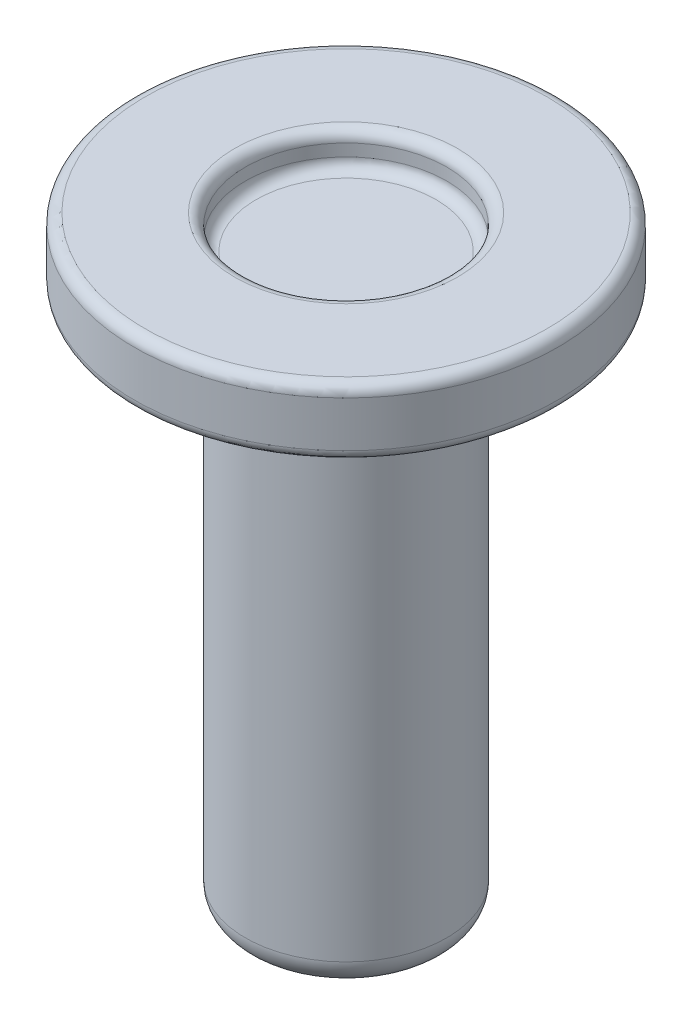
ISO-10303-21;
HEADER;
FILE_DESCRIPTION(('STEP AP214'),'2;1');
FILE_NAME('part.step','',(''),(''),'','','');
FILE_SCHEMA(('AUTOMOTIVE_DESIGN { 1 0 10303 214 1 1 1 1 }'));
ENDSEC;
DATA;
#1=APPLICATION_CONTEXT('core data for automotive mechanical design processes');
#2=APPLICATION_PROTOCOL_DEFINITION('international standard','automotive_design',2000,#1);
#3=PRODUCT_CONTEXT('',#1,'mechanical');
#4=PRODUCT('Part','Part','',(#3));
#5=PRODUCT_RELATED_PRODUCT_CATEGORY('part','',(#4));
#6=PRODUCT_DEFINITION_FORMATION('','',#4);
#7=PRODUCT_DEFINITION_CONTEXT('part definition',#1,'design');
#8=PRODUCT_DEFINITION('design','',#6,#7);
#9=PRODUCT_DEFINITION_SHAPE('','',#8);
#10=(LENGTH_UNIT() NAMED_UNIT(*) SI_UNIT(.MILLI.,.METRE.));
#11=(NAMED_UNIT(*) PLANE_ANGLE_UNIT() SI_UNIT($,.RADIAN.));
#12=(NAMED_UNIT(*) SI_UNIT($,.STERADIAN.) SOLID_ANGLE_UNIT());
#13=UNCERTAINTY_MEASURE_WITH_UNIT(LENGTH_MEASURE(1.E-05),#10,'distance_accuracy_value','');
#14=(GEOMETRIC_REPRESENTATION_CONTEXT(3) GLOBAL_UNCERTAINTY_ASSIGNED_CONTEXT((#13)) GLOBAL_UNIT_ASSIGNED_CONTEXT((#10,
#11,#12)) REPRESENTATION_CONTEXT('',''));
#15=CARTESIAN_POINT('',(0.,0.,0.));
#16=DIRECTION('',(0.,0.,1.));
#17=DIRECTION('',(1.,0.,0.));
#18=AXIS2_PLACEMENT_3D('',#15,#16,#17);
#19=CARTESIAN_POINT('',(-1.74625,-13.49375,0.));
#20=DIRECTION('',(0.,1.,0.));
#21=DIRECTION('',(0.,0.,1.));
#22=AXIS2_PLACEMENT_3D('',#19,#20,#21);
#23=PLANE('',#22);
#24=CARTESIAN_POINT('',(0.,-13.49375,0.));
#25=DIRECTION('',(0.,-1.,0.));
#26=DIRECTION('',(0.,0.,-1.));
#27=AXIS2_PLACEMENT_3D('',#24,#25,#26);
#28=CIRCLE('',#27,1.74625);
#29=CARTESIAN_POINT('',(0.,-13.49375,-1.74625));
#30=VERTEX_POINT('',#29);
#31=EDGE_CURVE('E10',#30,#30,#28,.T.);
#32=ORIENTED_EDGE('',*,*,#31,.T.);
#33=EDGE_LOOP('',(#32));
#34=FACE_BOUND('',#33,.T.);
#35=ADVANCED_FACE('F30',(#34),#23,.F.);
#36=CARTESIAN_POINT('',(0.,-12.85875,0.));
#37=DIRECTION('',(0.,-1.,0.));
#38=DIRECTION('',(0.,0.,-1.));
#39=AXIS2_PLACEMENT_3D('',#36,#37,#38);
#40=TOROIDAL_SURFACE('',#39,1.74625,0.635);
#41=ORIENTED_EDGE('',*,*,#31,.F.);
#42=EDGE_LOOP('',(#41));
#43=FACE_BOUND('',#42,.T.);
#44=CARTESIAN_POINT('',(0.,-12.85875,0.));
#45=DIRECTION('',(0.,-1.,0.));
#46=DIRECTION('',(0.,0.,-1.));
#47=AXIS2_PLACEMENT_3D('',#44,#45,#46);
#48=CIRCLE('',#47,2.38125);
#49=CARTESIAN_POINT('',(0.,-12.85875,-2.38125));
#50=VERTEX_POINT('',#49);
#51=EDGE_CURVE('E36',#50,#50,#48,.T.);
#52=ORIENTED_EDGE('',*,*,#51,.T.);
#53=EDGE_LOOP('',(#52));
#54=FACE_BOUND('',#53,.T.);
#55=ADVANCED_FACE('F86',(#43,#54),#40,.T.);
#56=CARTESIAN_POINT('',(0.,-13.49375,0.));
#57=DIRECTION('',(0.,-1.,0.));
#58=DIRECTION('',(0.,0.,-1.));
#59=AXIS2_PLACEMENT_3D('',#56,#57,#58);
#60=CYLINDRICAL_SURFACE('',#59,2.38125);
#61=ORIENTED_EDGE('',*,*,#51,.F.);
#62=EDGE_LOOP('',(#61));
#63=FACE_BOUND('',#62,.T.);
#64=CARTESIAN_POINT('',(0.,-1.04775,0.));
#65=DIRECTION('',(0.,-1.,0.));
#66=DIRECTION('',(0.,0.,-1.));
#67=AXIS2_PLACEMENT_3D('',#64,#65,#66);
#68=CIRCLE('',#67,2.38125);
#69=CARTESIAN_POINT('',(0.,-1.04775,-2.38125));
#70=VERTEX_POINT('',#69);
#71=EDGE_CURVE('E40',#70,#70,#68,.T.);
#72=ORIENTED_EDGE('',*,*,#71,.T.);
#73=EDGE_LOOP('',(#72));
#74=FACE_BOUND('',#73,.T.);
#75=ADVANCED_FACE('F90',(#63,#74),#60,.T.);
#76=CARTESIAN_POINT('',(0.,-1.04775,0.));
#77=DIRECTION('',(0.,-1.,0.));
#78=DIRECTION('',(0.,0.,-1.));
#79=AXIS2_PLACEMENT_3D('',#76,#77,#78);
#80=TOROIDAL_SURFACE('',#79,2.63525,0.254);
#81=ORIENTED_EDGE('',*,*,#71,.F.);
#82=EDGE_LOOP('',(#81));
#83=FACE_BOUND('',#82,.T.);
#84=CARTESIAN_POINT('',(0.,-0.793750000000001,0.));
#85=DIRECTION('',(0.,-1.,0.));
#86=DIRECTION('',(0.,0.,-1.));
#87=AXIS2_PLACEMENT_3D('',#84,#85,#86);
#88=CIRCLE('',#87,2.63525);
#89=CARTESIAN_POINT('',(0.,-0.793750000000001,-2.63525));
#90=VERTEX_POINT('',#89);
#91=EDGE_CURVE('E44',#90,#90,#88,.T.);
#92=ORIENTED_EDGE('',*,*,#91,.T.);
#93=EDGE_LOOP('',(#92));
#94=FACE_BOUND('',#93,.T.);
#95=ADVANCED_FACE('F95',(#83,#94),#80,.F.);
#96=CARTESIAN_POINT('',(-4.7498,-0.79375,0.));
#97=DIRECTION('',(0.,1.,0.));
#98=DIRECTION('',(0.,0.,1.));
#99=AXIS2_PLACEMENT_3D('',#96,#97,#98);
#100=PLANE('',#99);
#101=ORIENTED_EDGE('',*,*,#91,.F.);
#102=EDGE_LOOP('',(#101));
#103=FACE_BOUND('',#102,.T.);
#104=CARTESIAN_POINT('',(0.,-0.793750000000001,0.));
#105=DIRECTION('',(0.,-1.,0.));
#106=DIRECTION('',(0.,0.,-1.));
#107=AXIS2_PLACEMENT_3D('',#104,#105,#106);
#108=CIRCLE('',#107,4.7498);
#109=CARTESIAN_POINT('',(0.,-0.793750000000001,-4.7498));
#110=VERTEX_POINT('',#109);
#111=EDGE_CURVE('E49',#110,#110,#108,.T.);
#112=ORIENTED_EDGE('',*,*,#111,.T.);
#113=EDGE_LOOP('',(#112));
#114=FACE_BOUND('',#113,.T.);
#115=ADVANCED_FACE('F101',(#103,#114),#100,.F.);
#116=CARTESIAN_POINT('',(0.,-0.53975,0.));
#117=DIRECTION('',(0.,-1.,0.));
#118=DIRECTION('',(0.,0.,-1.));
#119=AXIS2_PLACEMENT_3D('',#116,#117,#118);
#120=TOROIDAL_SURFACE('',#119,4.7498,0.254);
#121=ORIENTED_EDGE('',*,*,#111,.F.);
#122=EDGE_LOOP('',(#121));
#123=FACE_BOUND('',#122,.T.);
#124=CARTESIAN_POINT('',(0.,-0.539749999999999,0.));
#125=DIRECTION('',(0.,-1.,0.));
#126=DIRECTION('',(0.,0.,-1.));
#127=AXIS2_PLACEMENT_3D('',#124,#125,#126);
#128=CIRCLE('',#127,5.0038);
#129=CARTESIAN_POINT('',(0.,-0.539749999999999,-5.0038));
#130=VERTEX_POINT('',#129);
#131=EDGE_CURVE('E52',#130,#130,#128,.T.);
#132=ORIENTED_EDGE('',*,*,#131,.T.);
#133=EDGE_LOOP('',(#132));
#134=FACE_BOUND('',#133,.T.);
#135=ADVANCED_FACE('F105',(#123,#134),#120,.T.);
#136=CARTESIAN_POINT('',(0.,-13.49375,0.));
#137=DIRECTION('',(0.,-1.,0.));
#138=DIRECTION('',(0.,0.,-1.));
#139=AXIS2_PLACEMENT_3D('',#136,#137,#138);
#140=CYLINDRICAL_SURFACE('',#139,5.0038);
#141=ORIENTED_EDGE('',*,*,#131,.F.);
#142=EDGE_LOOP('',(#141));
#143=FACE_BOUND('',#142,.T.);
#144=CARTESIAN_POINT('',(0.,0.539749999999999,0.));
#145=DIRECTION('',(0.,-1.,0.));
#146=DIRECTION('',(0.,0.,-1.));
#147=AXIS2_PLACEMENT_3D('',#144,#145,#146);
#148=CIRCLE('',#147,5.0038);
#149=CARTESIAN_POINT('',(0.,0.539749999999999,-5.0038));
#150=VERTEX_POINT('',#149);
#151=EDGE_CURVE('E55',#150,#150,#148,.T.);
#152=ORIENTED_EDGE('',*,*,#151,.T.);
#153=EDGE_LOOP('',(#152));
#154=FACE_BOUND('',#153,.T.);
#155=ADVANCED_FACE('F109',(#143,#154),#140,.T.);
#156=CARTESIAN_POINT('',(0.,0.53975,0.));
#157=DIRECTION('',(0.,-1.,0.));
#158=DIRECTION('',(0.,0.,-1.));
#159=AXIS2_PLACEMENT_3D('',#156,#157,#158);
#160=TOROIDAL_SURFACE('',#159,4.7498,0.254);
#161=ORIENTED_EDGE('',*,*,#151,.F.);
#162=EDGE_LOOP('',(#161));
#163=FACE_BOUND('',#162,.T.);
#164=CARTESIAN_POINT('',(0.,0.793749999999999,0.));
#165=DIRECTION('',(0.,-1.,0.));
#166=DIRECTION('',(0.,0.,-1.));
#167=AXIS2_PLACEMENT_3D('',#164,#165,#166);
#168=CIRCLE('',#167,4.7498);
#169=CARTESIAN_POINT('',(0.,0.793749999999999,-4.7498));
#170=VERTEX_POINT('',#169);
#171=EDGE_CURVE('E58',#170,#170,#168,.T.);
#172=ORIENTED_EDGE('',*,*,#171,.T.);
#173=EDGE_LOOP('',(#172));
#174=FACE_BOUND('',#173,.T.);
#175=ADVANCED_FACE('F113',(#163,#174),#160,.T.);
#176=CARTESIAN_POINT('',(-2.63525,0.79375,0.));
#177=DIRECTION('',(0.,-1.,0.));
#178=DIRECTION('',(0.,0.,-1.));
#179=AXIS2_PLACEMENT_3D('',#176,#177,#178);
#180=PLANE('',#179);
#181=ORIENTED_EDGE('',*,*,#171,.F.);
#182=EDGE_LOOP('',(#181));
#183=FACE_BOUND('',#182,.T.);
#184=CARTESIAN_POINT('',(0.,0.793749999999999,0.));
#185=DIRECTION('',(0.,-1.,0.));
#186=DIRECTION('',(0.,0.,-1.));
#187=AXIS2_PLACEMENT_3D('',#184,#185,#186);
#188=CIRCLE('',#187,2.63525);
#189=CARTESIAN_POINT('',(0.,0.793749999999999,-2.63525));
#190=VERTEX_POINT('',#189);
#191=EDGE_CURVE('E61',#190,#190,#188,.T.);
#192=ORIENTED_EDGE('',*,*,#191,.T.);
#193=EDGE_LOOP('',(#192));
#194=FACE_BOUND('',#193,.T.);
#195=ADVANCED_FACE('F117',(#183,#194),#180,.F.);
#196=CARTESIAN_POINT('',(0.,0.53975,0.));
#197=DIRECTION('',(0.,-1.,0.));
#198=DIRECTION('',(0.,0.,-1.));
#199=AXIS2_PLACEMENT_3D('',#196,#197,#198);
#200=TOROIDAL_SURFACE('',#199,2.63525,0.254);
#201=ORIENTED_EDGE('',*,*,#191,.F.);
#202=EDGE_LOOP('',(#201));
#203=FACE_BOUND('',#202,.T.);
#204=CARTESIAN_POINT('',(0.,0.539749999999999,0.));
#205=DIRECTION('',(0.,-1.,0.));
#206=DIRECTION('',(0.,0.,-1.));
#207=AXIS2_PLACEMENT_3D('',#204,#205,#206);
#208=CIRCLE('',#207,2.38125);
#209=CARTESIAN_POINT('',(0.,0.539749999999999,-2.38125));
#210=VERTEX_POINT('',#209);
#211=EDGE_CURVE('E64',#210,#210,#208,.T.);
#212=ORIENTED_EDGE('',*,*,#211,.T.);
#213=EDGE_LOOP('',(#212));
#214=FACE_BOUND('',#213,.T.);
#215=ADVANCED_FACE('F121',(#203,#214),#200,.T.);
#216=CARTESIAN_POINT('',(0.,-13.49375,0.));
#217=DIRECTION('',(0.,-1.,0.));
#218=DIRECTION('',(0.,0.,-1.));
#219=AXIS2_PLACEMENT_3D('',#216,#217,#218);
#220=CYLINDRICAL_SURFACE('',#219,2.38125);
#221=ORIENTED_EDGE('',*,*,#211,.F.);
#222=EDGE_LOOP('',(#221));
#223=FACE_BOUND('',#222,.T.);
#224=CARTESIAN_POINT('',(0.,0.253999999999999,0.));
#225=DIRECTION('',(0.,-1.,0.));
#226=DIRECTION('',(0.,0.,-1.));
#227=AXIS2_PLACEMENT_3D('',#224,#225,#226);
#228=CIRCLE('',#227,2.38125);
#229=CARTESIAN_POINT('',(0.,0.253999999999999,-2.38125));
#230=VERTEX_POINT('',#229);
#231=EDGE_CURVE('E67',#230,#230,#228,.T.);
#232=ORIENTED_EDGE('',*,*,#231,.T.);
#233=EDGE_LOOP('',(#232));
#234=FACE_BOUND('',#233,.T.);
#235=ADVANCED_FACE('F82',(#223,#234),#220,.F.);
#236=CARTESIAN_POINT('',(0.,0.254,0.));
#237=DIRECTION('',(0.,-1.,0.));
#238=DIRECTION('',(0.,0.,-1.));
#239=AXIS2_PLACEMENT_3D('',#236,#237,#238);
#240=TOROIDAL_SURFACE('',#239,2.12725,0.254);
#241=ORIENTED_EDGE('',*,*,#231,.F.);
#242=EDGE_LOOP('',(#241));
#243=FACE_BOUND('',#242,.T.);
#244=CARTESIAN_POINT('',(0.,0.,0.));
#245=DIRECTION('',(0.,-1.,0.));
#246=DIRECTION('',(0.,0.,-1.));
#247=AXIS2_PLACEMENT_3D('',#244,#245,#246);
#248=CIRCLE('',#247,2.12725);
#249=CARTESIAN_POINT('',(0.,0.,-2.12725));
#250=VERTEX_POINT('',#249);
#251=EDGE_CURVE('E70',#250,#250,#248,.T.);
#252=ORIENTED_EDGE('',*,*,#251,.T.);
#253=EDGE_LOOP('',(#252));
#254=FACE_BOUND('',#253,.T.);
#255=ADVANCED_FACE('F74',(#243,#254),#240,.F.);
#256=CARTESIAN_POINT('',(0.,0.,0.));
#257=DIRECTION('',(0.,-1.,0.));
#258=DIRECTION('',(0.,0.,-1.));
#259=AXIS2_PLACEMENT_3D('',#256,#257,#258);
#260=PLANE('',#259);
#261=ORIENTED_EDGE('',*,*,#251,.F.);
#262=EDGE_LOOP('',(#261));
#263=FACE_BOUND('',#262,.T.);
#264=ADVANCED_FACE('F76',(#263),#260,.F.);
#265=CLOSED_SHELL('',(#35,#55,#75,#95,#115,#135,#155,#175,#195,#215,#235,#255,#264));
#266=MANIFOLD_SOLID_BREP('B2',#265);
#267=ADVANCED_BREP_SHAPE_REPRESENTATION('',(#18,#266),#14);
#268=SHAPE_DEFINITION_REPRESENTATION(#9,#267);
ENDSEC;
END-ISO-10303-21;
